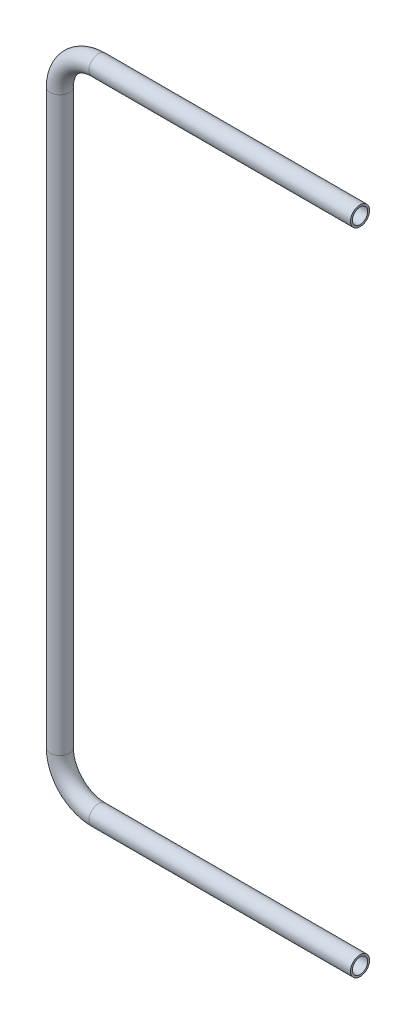
ISO-10303-21;
HEADER;
FILE_DESCRIPTION(('STEP AP214'),'2;1');
FILE_NAME('part.step','',(''),(''),'','','');
FILE_SCHEMA(('AUTOMOTIVE_DESIGN { 1 0 10303 214 1 1 1 1 }'));
ENDSEC;
DATA;
#1=APPLICATION_CONTEXT('core data for automotive mechanical design processes');
#2=APPLICATION_PROTOCOL_DEFINITION('international standard','automotive_design',2000,#1);
#3=PRODUCT_CONTEXT('',#1,'mechanical');
#4=PRODUCT('Part','Part','',(#3));
#5=PRODUCT_RELATED_PRODUCT_CATEGORY('part','',(#4));
#6=PRODUCT_DEFINITION_FORMATION('','',#4);
#7=PRODUCT_DEFINITION_CONTEXT('part definition',#1,'design');
#8=PRODUCT_DEFINITION('design','',#6,#7);
#9=PRODUCT_DEFINITION_SHAPE('','',#8);
#10=(LENGTH_UNIT() NAMED_UNIT(*) SI_UNIT(.MILLI.,.METRE.));
#11=(NAMED_UNIT(*) PLANE_ANGLE_UNIT() SI_UNIT($,.RADIAN.));
#12=(NAMED_UNIT(*) SI_UNIT($,.STERADIAN.) SOLID_ANGLE_UNIT());
#13=UNCERTAINTY_MEASURE_WITH_UNIT(LENGTH_MEASURE(1.E-05),#10,'distance_accuracy_value','');
#14=(GEOMETRIC_REPRESENTATION_CONTEXT(3) GLOBAL_UNCERTAINTY_ASSIGNED_CONTEXT((#13)) GLOBAL_UNIT_ASSIGNED_CONTEXT((#10,
#11,#12)) REPRESENTATION_CONTEXT('',''));
#15=CARTESIAN_POINT('',(0.,0.,0.));
#16=DIRECTION('',(0.,0.,1.));
#17=DIRECTION('',(1.,0.,0.));
#18=AXIS2_PLACEMENT_3D('',#15,#16,#17);
#19=CARTESIAN_POINT('',(0.,0.,0.));
#20=DIRECTION('',(-1.,0.,0.));
#21=DIRECTION('',(0.,-1.,0.));
#22=AXIS2_PLACEMENT_3D('',#19,#20,#21);
#23=CYLINDRICAL_SURFACE('',#22,16.7005);
#24=CARTESIAN_POINT('',(-457.2,0.,0.));
#25=DIRECTION('',(1.,0.,0.));
#26=DIRECTION('',(0.,0.,-1.));
#27=AXIS2_PLACEMENT_3D('',#24,#25,#26);
#28=CIRCLE('',#27,16.7005);
#29=CARTESIAN_POINT('',(-457.2,-16.7005000000001,0.));
#30=VERTEX_POINT('',#29);
#31=EDGE_CURVE('E120',#30,#30,#28,.T.);
#32=ORIENTED_EDGE('',*,*,#31,.T.);
#33=EDGE_LOOP('',(#32));
#34=FACE_BOUND('',#33,.T.);
#35=CARTESIAN_POINT('',(0.,0.,0.));
#36=DIRECTION('',(1.,0.,0.));
#37=DIRECTION('',(0.,0.,-1.));
#38=AXIS2_PLACEMENT_3D('',#35,#36,#37);
#39=CIRCLE('',#38,16.7005);
#40=CARTESIAN_POINT('',(0.,0.,-16.7005));
#41=VERTEX_POINT('',#40);
#42=EDGE_CURVE('E54',#41,#41,#39,.T.);
#43=ORIENTED_EDGE('',*,*,#42,.F.);
#44=EDGE_LOOP('',(#43));
#45=FACE_BOUND('',#44,.T.);
#46=ADVANCED_FACE('F39',(#34,#45),#23,.T.);
#47=CARTESIAN_POINT('',(-457.2,67.5004999999999,0.));
#48=DIRECTION('',(0.,0.,-1.));
#49=DIRECTION('',(-1.,0.,0.));
#50=AXIS2_PLACEMENT_3D('',#47,#48,#49);
#51=TOROIDAL_SURFACE('',#50,67.5005,16.7005);
#52=CARTESIAN_POINT('',(-524.7005,67.5004999999999,0.));
#53=DIRECTION('',(0.,-1.,0.));
#54=DIRECTION('',(0.,0.,-1.));
#55=AXIS2_PLACEMENT_3D('',#52,#53,#54);
#56=CIRCLE('',#55,16.7005);
#57=CARTESIAN_POINT('',(-541.401,67.5004999999999,0.));
#58=VERTEX_POINT('',#57);
#59=EDGE_CURVE('E123',#58,#58,#56,.T.);
#60=CARTESIAN_POINT('',(-457.2,67.5004999999999,0.));
#61=DIRECTION('',(0.,0.,-1.));
#62=DIRECTION('',(-1.,0.,0.));
#63=AXIS2_PLACEMENT_3D('',#60,#61,#62);
#64=CIRCLE('',#63,84.201);
#65=EDGE_CURVE('',#30,#58,#64,.T.);
#66=ORIENTED_EDGE('',*,*,#31,.F.);
#67=ORIENTED_EDGE('',*,*,#59,.T.);
#68=ORIENTED_EDGE('',*,*,#65,.T.);
#69=ORIENTED_EDGE('',*,*,#65,.F.);
#70=EDGE_LOOP('',(#66,#68,#67,#69));
#71=FACE_BOUND('',#70,.T.);
#72=ADVANCED_FACE('F144',(#71),#51,.T.);
#73=CARTESIAN_POINT('',(-524.7005,67.5004999999999,0.));
#74=DIRECTION('',(0.,1.,0.));
#75=DIRECTION('',(-1.,0.,0.));
#76=AXIS2_PLACEMENT_3D('',#73,#74,#75);
#77=CYLINDRICAL_SURFACE('',#76,16.7005);
#78=CARTESIAN_POINT('',(-524.7005,1067.562,0.));
#79=DIRECTION('',(0.,-1.,0.));
#80=DIRECTION('',(0.,0.,-1.));
#81=AXIS2_PLACEMENT_3D('',#78,#79,#80);
#82=CIRCLE('',#81,16.7005);
#83=CARTESIAN_POINT('',(-541.401,1067.562,0.));
#84=VERTEX_POINT('',#83);
#85=EDGE_CURVE('E125',#84,#84,#82,.T.);
#86=ORIENTED_EDGE('',*,*,#85,.T.);
#87=EDGE_LOOP('',(#86));
#88=FACE_BOUND('',#87,.T.);
#89=ORIENTED_EDGE('',*,*,#59,.F.);
#90=EDGE_LOOP('',(#89));
#91=FACE_BOUND('',#90,.T.);
#92=ADVANCED_FACE('F140',(#88,#91),#77,.T.);
#93=CARTESIAN_POINT('',(-457.2,1067.562,0.));
#94=DIRECTION('',(0.,0.,-1.));
#95=DIRECTION('',(-1.,0.,0.));
#96=AXIS2_PLACEMENT_3D('',#93,#94,#95);
#97=TOROIDAL_SURFACE('',#96,67.5005,16.7005);
#98=CARTESIAN_POINT('',(-457.2,1135.0625,0.));
#99=DIRECTION('',(-1.,0.,0.));
#100=DIRECTION('',(0.,0.,-1.));
#101=AXIS2_PLACEMENT_3D('',#98,#99,#100);
#102=CIRCLE('',#101,16.7005);
#103=CARTESIAN_POINT('',(-457.2,1151.763,0.));
#104=VERTEX_POINT('',#103);
#105=EDGE_CURVE('E43',#104,#104,#102,.T.);
#106=CARTESIAN_POINT('',(-457.2,1067.562,0.));
#107=DIRECTION('',(0.,0.,-1.));
#108=DIRECTION('',(-1.,0.,0.));
#109=AXIS2_PLACEMENT_3D('',#106,#107,#108);
#110=CIRCLE('',#109,84.201);
#111=EDGE_CURVE('',#84,#104,#110,.T.);
#112=ORIENTED_EDGE('',*,*,#85,.F.);
#113=ORIENTED_EDGE('',*,*,#105,.T.);
#114=ORIENTED_EDGE('',*,*,#111,.T.);
#115=ORIENTED_EDGE('',*,*,#111,.F.);
#116=EDGE_LOOP('',(#112,#114,#113,#115));
#117=FACE_BOUND('',#116,.T.);
#118=ADVANCED_FACE('F132',(#117),#97,.T.);
#119=CARTESIAN_POINT('',(-457.2,1135.0625,0.));
#120=DIRECTION('',(1.,0.,0.));
#121=DIRECTION('',(0.,1.,0.));
#122=AXIS2_PLACEMENT_3D('',#119,#120,#121);
#123=CYLINDRICAL_SURFACE('',#122,16.7005);
#124=CARTESIAN_POINT('',(-3.33066907387547E-13,1135.0625,0.));
#125=DIRECTION('',(-1.,0.,0.));
#126=DIRECTION('',(0.,0.,-1.));
#127=AXIS2_PLACEMENT_3D('',#124,#125,#126);
#128=CIRCLE('',#127,16.7005);
#129=CARTESIAN_POINT('',(-3.33066907387547E-13,1135.0625,-16.7005));
#130=VERTEX_POINT('',#129);
#131=EDGE_CURVE('E59',#130,#130,#128,.T.);
#132=ORIENTED_EDGE('',*,*,#131,.T.);
#133=EDGE_LOOP('',(#132));
#134=FACE_BOUND('',#133,.T.);
#135=ORIENTED_EDGE('',*,*,#105,.F.);
#136=EDGE_LOOP('',(#135));
#137=FACE_BOUND('',#136,.T.);
#138=ADVANCED_FACE('F41',(#134,#137),#123,.T.);
#139=CARTESIAN_POINT('',(0.,0.,0.));
#140=DIRECTION('',(1.,0.,0.));
#141=DIRECTION('',(0.,0.,-1.));
#142=AXIS2_PLACEMENT_3D('',#139,#140,#141);
#143=PLANE('',#142);
#144=CARTESIAN_POINT('',(0.,0.,0.));
#145=DIRECTION('',(1.,0.,0.));
#146=DIRECTION('',(0.,0.,-1.));
#147=AXIS2_PLACEMENT_3D('',#144,#145,#146);
#148=CIRCLE('',#147,13.335);
#149=CARTESIAN_POINT('',(0.,0.,-13.335));
#150=VERTEX_POINT('',#149);
#151=EDGE_CURVE('E107',#150,#150,#148,.F.);
#152=ORIENTED_EDGE('',*,*,#151,.T.);
#153=EDGE_LOOP('',(#152));
#154=FACE_BOUND('',#153,.T.);
#155=ORIENTED_EDGE('',*,*,#42,.T.);
#156=EDGE_LOOP('',(#155));
#157=FACE_BOUND('',#156,.T.);
#158=ADVANCED_FACE('F72',(#154,#157),#143,.T.);
#159=CARTESIAN_POINT('',(-3.33066907387547E-13,1135.0625,0.));
#160=DIRECTION('',(-1.,0.,0.));
#161=DIRECTION('',(0.,0.,-1.));
#162=AXIS2_PLACEMENT_3D('',#159,#160,#161);
#163=PLANE('',#162);
#164=CARTESIAN_POINT('',(-3.33066907387547E-13,1135.0625,0.));
#165=DIRECTION('',(-1.,0.,0.));
#166=DIRECTION('',(0.,0.,-1.));
#167=AXIS2_PLACEMENT_3D('',#164,#165,#166);
#168=CIRCLE('',#167,13.335);
#169=CARTESIAN_POINT('',(-3.33066907387547E-13,1135.0625,-13.335));
#170=VERTEX_POINT('',#169);
#171=EDGE_CURVE('E11',#170,#170,#168,.F.);
#172=ORIENTED_EDGE('',*,*,#171,.F.);
#173=EDGE_LOOP('',(#172));
#174=FACE_BOUND('',#173,.T.);
#175=ORIENTED_EDGE('',*,*,#131,.F.);
#176=EDGE_LOOP('',(#175));
#177=FACE_BOUND('',#176,.T.);
#178=ADVANCED_FACE('F69',(#174,#177),#163,.F.);
#179=CARTESIAN_POINT('',(0.,0.,0.));
#180=DIRECTION('',(-1.,0.,0.));
#181=DIRECTION('',(0.,-1.,0.));
#182=AXIS2_PLACEMENT_3D('',#179,#180,#181);
#183=CYLINDRICAL_SURFACE('',#182,13.335);
#184=CARTESIAN_POINT('',(-457.2,0.,0.));
#185=DIRECTION('',(1.,0.,0.));
#186=DIRECTION('',(0.,0.,-1.));
#187=AXIS2_PLACEMENT_3D('',#184,#185,#186);
#188=CIRCLE('',#187,13.335);
#189=CARTESIAN_POINT('',(-457.2,-13.3350000000001,0.));
#190=VERTEX_POINT('',#189);
#191=EDGE_CURVE('E106',#190,#190,#188,.F.);
#192=ORIENTED_EDGE('',*,*,#191,.T.);
#193=EDGE_LOOP('',(#192));
#194=FACE_BOUND('',#193,.T.);
#195=ORIENTED_EDGE('',*,*,#151,.F.);
#196=EDGE_LOOP('',(#195));
#197=FACE_BOUND('',#196,.T.);
#198=ADVANCED_FACE('F71',(#194,#197),#183,.F.);
#199=CARTESIAN_POINT('',(-457.2,67.5004999999999,0.));
#200=DIRECTION('',(0.,0.,-1.));
#201=DIRECTION('',(-1.,0.,0.));
#202=AXIS2_PLACEMENT_3D('',#199,#200,#201);
#203=TOROIDAL_SURFACE('',#202,67.5005,13.335);
#204=CARTESIAN_POINT('',(-524.7005,67.5004999999999,0.));
#205=DIRECTION('',(0.,-1.,0.));
#206=DIRECTION('',(0.,0.,-1.));
#207=AXIS2_PLACEMENT_3D('',#204,#205,#206);
#208=CIRCLE('',#207,13.335);
#209=CARTESIAN_POINT('',(-538.0355,67.5004999999999,0.));
#210=VERTEX_POINT('',#209);
#211=EDGE_CURVE('E103',#210,#210,#208,.F.);
#212=CARTESIAN_POINT('',(-457.2,67.5004999999999,0.));
#213=DIRECTION('',(0.,0.,-1.));
#214=DIRECTION('',(-1.,0.,0.));
#215=AXIS2_PLACEMENT_3D('',#212,#213,#214);
#216=CIRCLE('',#215,80.8355);
#217=EDGE_CURVE('',#190,#210,#216,.T.);
#218=ORIENTED_EDGE('',*,*,#191,.F.);
#219=ORIENTED_EDGE('',*,*,#211,.T.);
#220=ORIENTED_EDGE('',*,*,#217,.T.);
#221=ORIENTED_EDGE('',*,*,#217,.F.);
#222=EDGE_LOOP('',(#218,#220,#219,#221));
#223=FACE_BOUND('',#222,.T.);
#224=ADVANCED_FACE('F78',(#223),#203,.F.);
#225=CARTESIAN_POINT('',(-524.7005,67.5004999999999,0.));
#226=DIRECTION('',(0.,1.,0.));
#227=DIRECTION('',(-1.,0.,0.));
#228=AXIS2_PLACEMENT_3D('',#225,#226,#227);
#229=CYLINDRICAL_SURFACE('',#228,13.335);
#230=CARTESIAN_POINT('',(-524.7005,1067.562,0.));
#231=DIRECTION('',(0.,-1.,0.));
#232=DIRECTION('',(0.,0.,-1.));
#233=AXIS2_PLACEMENT_3D('',#230,#231,#232);
#234=CIRCLE('',#233,13.335);
#235=CARTESIAN_POINT('',(-538.0355,1067.562,0.));
#236=VERTEX_POINT('',#235);
#237=EDGE_CURVE('E109',#236,#236,#234,.F.);
#238=ORIENTED_EDGE('',*,*,#237,.T.);
#239=EDGE_LOOP('',(#238));
#240=FACE_BOUND('',#239,.T.);
#241=ORIENTED_EDGE('',*,*,#211,.F.);
#242=EDGE_LOOP('',(#241));
#243=FACE_BOUND('',#242,.T.);
#244=ADVANCED_FACE('F89',(#240,#243),#229,.F.);
#245=CARTESIAN_POINT('',(-457.2,1067.562,0.));
#246=DIRECTION('',(0.,0.,-1.));
#247=DIRECTION('',(-1.,0.,0.));
#248=AXIS2_PLACEMENT_3D('',#245,#246,#247);
#249=TOROIDAL_SURFACE('',#248,67.5005,13.335);
#250=CARTESIAN_POINT('',(-457.2,1135.0625,0.));
#251=DIRECTION('',(-1.,0.,0.));
#252=DIRECTION('',(0.,0.,-1.));
#253=AXIS2_PLACEMENT_3D('',#250,#251,#252);
#254=CIRCLE('',#253,13.335);
#255=CARTESIAN_POINT('',(-457.2,1148.3975,0.));
#256=VERTEX_POINT('',#255);
#257=EDGE_CURVE('E48',#256,#256,#254,.F.);
#258=CARTESIAN_POINT('',(-457.2,1067.562,0.));
#259=DIRECTION('',(0.,0.,-1.));
#260=DIRECTION('',(-1.,0.,0.));
#261=AXIS2_PLACEMENT_3D('',#258,#259,#260);
#262=CIRCLE('',#261,80.8355);
#263=EDGE_CURVE('',#236,#256,#262,.T.);
#264=ORIENTED_EDGE('',*,*,#237,.F.);
#265=ORIENTED_EDGE('',*,*,#257,.T.);
#266=ORIENTED_EDGE('',*,*,#263,.T.);
#267=ORIENTED_EDGE('',*,*,#263,.F.);
#268=EDGE_LOOP('',(#264,#266,#265,#267));
#269=FACE_BOUND('',#268,.T.);
#270=ADVANCED_FACE('F85',(#269),#249,.F.);
#271=CARTESIAN_POINT('',(-457.2,1135.0625,0.));
#272=DIRECTION('',(1.,0.,0.));
#273=DIRECTION('',(0.,1.,0.));
#274=AXIS2_PLACEMENT_3D('',#271,#272,#273);
#275=CYLINDRICAL_SURFACE('',#274,13.335);
#276=ORIENTED_EDGE('',*,*,#171,.T.);
#277=EDGE_LOOP('',(#276));
#278=FACE_BOUND('',#277,.T.);
#279=ORIENTED_EDGE('',*,*,#257,.F.);
#280=EDGE_LOOP('',(#279));
#281=FACE_BOUND('',#280,.T.);
#282=ADVANCED_FACE('F66',(#278,#281),#275,.F.);
#283=CLOSED_SHELL('',(#46,#72,#92,#118,#138,#158,#178,#198,#224,#244,#270,#282));
#284=MANIFOLD_SOLID_BREP('B2',#283);
#285=ADVANCED_BREP_SHAPE_REPRESENTATION('',(#18,#284),#14);
#286=SHAPE_DEFINITION_REPRESENTATION(#9,#285);
ENDSEC;
END-ISO-10303-21;
